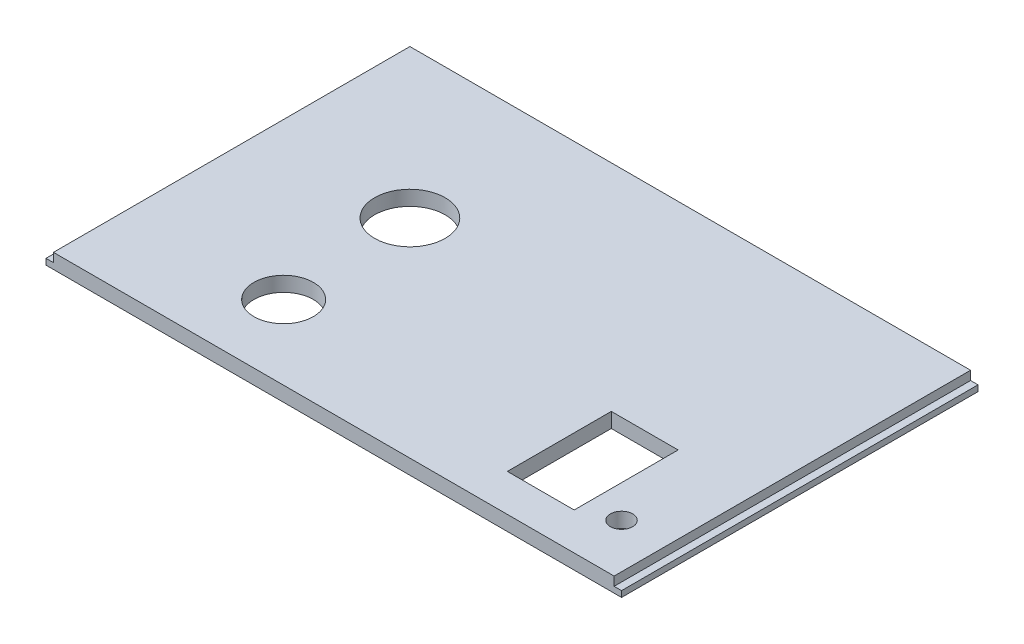
ISO-10303-21;
HEADER;
FILE_DESCRIPTION(('STEP AP214'),'2;1');
FILE_NAME('part.step','',(''),(''),'','','');
FILE_SCHEMA(('AUTOMOTIVE_DESIGN { 1 0 10303 214 1 1 1 1 }'));
ENDSEC;
DATA;
#1=APPLICATION_CONTEXT('core data for automotive mechanical design processes');
#2=APPLICATION_PROTOCOL_DEFINITION('international standard','automotive_design',2000,#1);
#3=PRODUCT_CONTEXT('',#1,'mechanical');
#4=PRODUCT('Part','Part','',(#3));
#5=PRODUCT_RELATED_PRODUCT_CATEGORY('part','',(#4));
#6=PRODUCT_DEFINITION_FORMATION('','',#4);
#7=PRODUCT_DEFINITION_CONTEXT('part definition',#1,'design');
#8=PRODUCT_DEFINITION('design','',#6,#7);
#9=PRODUCT_DEFINITION_SHAPE('','',#8);
#10=(LENGTH_UNIT() NAMED_UNIT(*) SI_UNIT(.MILLI.,.METRE.));
#11=(NAMED_UNIT(*) PLANE_ANGLE_UNIT() SI_UNIT($,.RADIAN.));
#12=(NAMED_UNIT(*) SI_UNIT($,.STERADIAN.) SOLID_ANGLE_UNIT());
#13=UNCERTAINTY_MEASURE_WITH_UNIT(LENGTH_MEASURE(1.E-05),#10,'distance_accuracy_value','');
#14=(GEOMETRIC_REPRESENTATION_CONTEXT(3) GLOBAL_UNCERTAINTY_ASSIGNED_CONTEXT((#13)) GLOBAL_UNIT_ASSIGNED_CONTEXT((#10,
#11,#12)) REPRESENTATION_CONTEXT('',''));
#15=CARTESIAN_POINT('',(0.,0.,0.));
#16=DIRECTION('',(0.,0.,1.));
#17=DIRECTION('',(1.,0.,0.));
#18=AXIS2_PLACEMENT_3D('',#15,#16,#17);
#19=CARTESIAN_POINT('',(0.,2.,0.));
#20=DIRECTION('',(1.,0.,0.));
#21=DIRECTION('',(0.,0.,-1.));
#22=AXIS2_PLACEMENT_3D('',#19,#20,#21);
#23=PLANE('',#22);
#24=DIRECTION('',(0.,0.,1.));
#25=VECTOR('',#24,1.);
#26=CARTESIAN_POINT('',(0.,0.8,-48.));
#27=LINE('',#26,#25);
#28=CARTESIAN_POINT('',(0.,0.8,-48.));
#29=VERTEX_POINT('',#28);
#30=CARTESIAN_POINT('',(0.,0.8,0.));
#31=VERTEX_POINT('',#30);
#32=EDGE_CURVE('E175',#29,#31,#27,.T.);
#33=ORIENTED_EDGE('',*,*,#32,.F.);
#34=DIRECTION('',(0.,-1.,0.));
#35=VECTOR('',#34,1.);
#36=CARTESIAN_POINT('',(0.,2.,-48.));
#37=LINE('',#36,#35);
#38=CARTESIAN_POINT('',(0.,0.,-48.));
#39=VERTEX_POINT('',#38);
#40=EDGE_CURVE('E232',#29,#39,#37,.T.);
#41=ORIENTED_EDGE('',*,*,#40,.T.);
#42=DIRECTION('',(0.,0.,1.));
#43=VECTOR('',#42,1.);
#44=CARTESIAN_POINT('',(0.,0.,0.));
#45=LINE('',#44,#43);
#46=CARTESIAN_POINT('',(0.,0.,0.));
#47=VERTEX_POINT('',#46);
#48=EDGE_CURVE('E198',#39,#47,#45,.T.);
#49=ORIENTED_EDGE('',*,*,#48,.T.);
#50=DIRECTION('',(0.,-1.,0.));
#51=VECTOR('',#50,1.);
#52=CARTESIAN_POINT('',(0.,2.,0.));
#53=LINE('',#52,#51);
#54=EDGE_CURVE('E255',#31,#47,#53,.T.);
#55=ORIENTED_EDGE('',*,*,#54,.F.);
#56=EDGE_LOOP('',(#33,#41,#49,#55));
#57=FACE_BOUND('',#56,.T.);
#58=ADVANCED_FACE('F39',(#57),#23,.F.);
#59=CARTESIAN_POINT('',(0.,2.,0.));
#60=DIRECTION('',(0.,0.,-1.));
#61=DIRECTION('',(-1.,0.,0.));
#62=AXIS2_PLACEMENT_3D('',#59,#60,#61);
#63=PLANE('',#62);
#64=DIRECTION('',(1.,0.,0.));
#65=VECTOR('',#64,1.);
#66=CARTESIAN_POINT('',(0.,2.,0.));
#67=LINE('',#66,#65);
#68=CARTESIAN_POINT('',(1.00000000000001,2.,0.));
#69=VERTEX_POINT('',#68);
#70=CARTESIAN_POINT('',(76.5,2.,0.));
#71=VERTEX_POINT('',#70);
#72=EDGE_CURVE('E223',#69,#71,#67,.T.);
#73=ORIENTED_EDGE('',*,*,#72,.F.);
#74=DIRECTION('',(0.,1.,0.));
#75=VECTOR('',#74,1.);
#76=CARTESIAN_POINT('',(1.00000000000001,0.8,0.));
#77=LINE('',#76,#75);
#78=CARTESIAN_POINT('',(1.00000000000001,0.8,0.));
#79=VERTEX_POINT('',#78);
#80=EDGE_CURVE('E190',#79,#69,#77,.T.);
#81=ORIENTED_EDGE('',*,*,#80,.F.);
#82=DIRECTION('',(1.,0.,0.));
#83=VECTOR('',#82,1.);
#84=CARTESIAN_POINT('',(0.,0.8,0.));
#85=LINE('',#84,#83);
#86=EDGE_CURVE('E178',#31,#79,#85,.T.);
#87=ORIENTED_EDGE('',*,*,#86,.F.);
#88=ORIENTED_EDGE('',*,*,#54,.T.);
#89=DIRECTION('',(1.,0.,0.));
#90=VECTOR('',#89,1.);
#91=CARTESIAN_POINT('',(0.,0.,0.));
#92=LINE('',#91,#90);
#93=CARTESIAN_POINT('',(77.5,0.,0.));
#94=VERTEX_POINT('',#93);
#95=EDGE_CURVE('E236',#47,#94,#92,.T.);
#96=ORIENTED_EDGE('',*,*,#95,.T.);
#97=DIRECTION('',(0.,-1.,0.));
#98=VECTOR('',#97,1.);
#99=CARTESIAN_POINT('',(77.5,2.,0.));
#100=LINE('',#99,#98);
#101=CARTESIAN_POINT('',(77.5,0.8,0.));
#102=VERTEX_POINT('',#101);
#103=EDGE_CURVE('E252',#102,#94,#100,.T.);
#104=ORIENTED_EDGE('',*,*,#103,.F.);
#105=DIRECTION('',(1.,0.,0.));
#106=VECTOR('',#105,1.);
#107=CARTESIAN_POINT('',(77.5,0.8,0.));
#108=LINE('',#107,#106);
#109=CARTESIAN_POINT('',(76.5,0.8,0.));
#110=VERTEX_POINT('',#109);
#111=EDGE_CURVE('E212',#110,#102,#108,.T.);
#112=ORIENTED_EDGE('',*,*,#111,.F.);
#113=DIRECTION('',(0.,1.,0.));
#114=VECTOR('',#113,1.);
#115=CARTESIAN_POINT('',(76.5,0.8,0.));
#116=LINE('',#115,#114);
#117=EDGE_CURVE('E193',#110,#71,#116,.T.);
#118=ORIENTED_EDGE('',*,*,#117,.T.);
#119=EDGE_LOOP('',(#73,#81,#87,#88,#96,#104,#112,#118));
#120=FACE_BOUND('',#119,.T.);
#121=ADVANCED_FACE('F303',(#120),#63,.F.);
#122=CARTESIAN_POINT('',(77.5,2.,0.));
#123=DIRECTION('',(-1.,0.,0.));
#124=DIRECTION('',(0.,0.,1.));
#125=AXIS2_PLACEMENT_3D('',#122,#123,#124);
#126=PLANE('',#125);
#127=DIRECTION('',(0.,-1.,0.));
#128=VECTOR('',#127,1.);
#129=CARTESIAN_POINT('',(77.5,2.,-48.));
#130=LINE('',#129,#128);
#131=CARTESIAN_POINT('',(77.5,0.8,-48.));
#132=VERTEX_POINT('',#131);
#133=CARTESIAN_POINT('',(77.5,0.,-48.));
#134=VERTEX_POINT('',#133);
#135=EDGE_CURVE('E249',#132,#134,#130,.T.);
#136=ORIENTED_EDGE('',*,*,#135,.F.);
#137=DIRECTION('',(0.,0.,-1.));
#138=VECTOR('',#137,1.);
#139=CARTESIAN_POINT('',(77.5,0.8,-48.));
#140=LINE('',#139,#138);
#141=EDGE_CURVE('E201',#102,#132,#140,.T.);
#142=ORIENTED_EDGE('',*,*,#141,.F.);
#143=ORIENTED_EDGE('',*,*,#103,.T.);
#144=DIRECTION('',(0.,0.,-1.));
#145=VECTOR('',#144,1.);
#146=CARTESIAN_POINT('',(77.5,0.,0.));
#147=LINE('',#146,#145);
#148=EDGE_CURVE('E240',#94,#134,#147,.T.);
#149=ORIENTED_EDGE('',*,*,#148,.T.);
#150=EDGE_LOOP('',(#136,#142,#143,#149));
#151=FACE_BOUND('',#150,.T.);
#152=ADVANCED_FACE('F298',(#151),#126,.F.);
#153=CARTESIAN_POINT('',(0.,2.,-48.));
#154=DIRECTION('',(0.,0.,1.));
#155=DIRECTION('',(1.,0.,0.));
#156=AXIS2_PLACEMENT_3D('',#153,#154,#155);
#157=PLANE('',#156);
#158=DIRECTION('',(-1.,0.,0.));
#159=VECTOR('',#158,1.);
#160=CARTESIAN_POINT('',(0.,0.8,-48.));
#161=LINE('',#160,#159);
#162=CARTESIAN_POINT('',(1.,0.8,-48.));
#163=VERTEX_POINT('',#162);
#164=EDGE_CURVE('E187',#163,#29,#161,.T.);
#165=ORIENTED_EDGE('',*,*,#164,.F.);
#166=DIRECTION('',(0.,1.,0.));
#167=VECTOR('',#166,1.);
#168=CARTESIAN_POINT('',(1.,0.8,-48.));
#169=LINE('',#168,#167);
#170=CARTESIAN_POINT('',(1.,2.,-48.));
#171=VERTEX_POINT('',#170);
#172=EDGE_CURVE('E194',#163,#171,#169,.T.);
#173=ORIENTED_EDGE('',*,*,#172,.T.);
#174=DIRECTION('',(-1.,0.,0.));
#175=VECTOR('',#174,1.);
#176=CARTESIAN_POINT('',(0.,2.,-48.));
#177=LINE('',#176,#175);
#178=CARTESIAN_POINT('',(76.5,2.,-48.));
#179=VERTEX_POINT('',#178);
#180=EDGE_CURVE('E227',#179,#171,#177,.T.);
#181=ORIENTED_EDGE('',*,*,#180,.F.);
#182=DIRECTION('',(0.,1.,0.));
#183=VECTOR('',#182,1.);
#184=CARTESIAN_POINT('',(76.5,0.8,-48.));
#185=LINE('',#184,#183);
#186=CARTESIAN_POINT('',(76.5,0.8,-48.));
#187=VERTEX_POINT('',#186);
#188=EDGE_CURVE('E215',#187,#179,#185,.T.);
#189=ORIENTED_EDGE('',*,*,#188,.F.);
#190=DIRECTION('',(-1.,0.,0.));
#191=VECTOR('',#190,1.);
#192=CARTESIAN_POINT('',(77.5,0.8,-48.));
#193=LINE('',#192,#191);
#194=EDGE_CURVE('E204',#132,#187,#193,.T.);
#195=ORIENTED_EDGE('',*,*,#194,.F.);
#196=ORIENTED_EDGE('',*,*,#135,.T.);
#197=DIRECTION('',(-1.,0.,0.));
#198=VECTOR('',#197,1.);
#199=CARTESIAN_POINT('',(0.,0.,-48.));
#200=LINE('',#199,#198);
#201=EDGE_CURVE('E228',#134,#39,#200,.T.);
#202=ORIENTED_EDGE('',*,*,#201,.T.);
#203=ORIENTED_EDGE('',*,*,#40,.F.);
#204=EDGE_LOOP('',(#165,#173,#181,#189,#195,#196,#202,#203));
#205=FACE_BOUND('',#204,.T.);
#206=ADVANCED_FACE('F289',(#205),#157,.F.);
#207=CARTESIAN_POINT('',(0.,2.,0.));
#208=DIRECTION('',(0.,-1.,0.));
#209=DIRECTION('',(0.,0.,-1.));
#210=AXIS2_PLACEMENT_3D('',#207,#208,#209);
#211=PLANE('',#210);
#212=CARTESIAN_POINT('',(21.,2.,-28.));
#213=DIRECTION('',(0.,1.,0.));
#214=DIRECTION('',(0.,0.,1.));
#215=AXIS2_PLACEMENT_3D('',#212,#213,#214);
#216=CIRCLE('',#215,4.75);
#217=CARTESIAN_POINT('',(21.,2.,-23.25));
#218=VERTEX_POINT('',#217);
#219=EDGE_CURVE('E274',#218,#218,#216,.T.);
#220=ORIENTED_EDGE('',*,*,#219,.F.);
#221=EDGE_LOOP('',(#220));
#222=FACE_BOUND('',#221,.T.);
#223=CARTESIAN_POINT('',(70.5,2.,-7.));
#224=DIRECTION('',(0.,1.,0.));
#225=DIRECTION('',(0.,0.,1.));
#226=AXIS2_PLACEMENT_3D('',#223,#224,#225);
#227=CIRCLE('',#226,1.5);
#228=CARTESIAN_POINT('',(70.5,2.,-5.5));
#229=VERTEX_POINT('',#228);
#230=EDGE_CURVE('E160',#229,#229,#227,.T.);
#231=ORIENTED_EDGE('',*,*,#230,.F.);
#232=EDGE_LOOP('',(#231));
#233=FACE_BOUND('',#232,.T.);
#234=DIRECTION('',(1.,0.,0.));
#235=VECTOR('',#234,1.);
#236=CARTESIAN_POINT('',(57.1084226261721,2.,-5.01303201692949));
#237=LINE('',#236,#235);
#238=CARTESIAN_POINT('',(57.1084226261721,2.,-5.01303201692949));
#239=VERTEX_POINT('',#238);
#240=CARTESIAN_POINT('',(66.1084226261721,2.,-5.01303201692949));
#241=VERTEX_POINT('',#240);
#242=EDGE_CURVE('E142',#239,#241,#237,.T.);
#243=ORIENTED_EDGE('',*,*,#242,.F.);
#244=DIRECTION('',(0.,0.,1.));
#245=VECTOR('',#244,1.);
#246=CARTESIAN_POINT('',(57.1084226261721,2.,-19.0130320169295));
#247=LINE('',#246,#245);
#248=CARTESIAN_POINT('',(57.1084226261721,2.,-19.0130320169295));
#249=VERTEX_POINT('',#248);
#250=EDGE_CURVE('E56',#249,#239,#247,.T.);
#251=ORIENTED_EDGE('',*,*,#250,.F.);
#252=DIRECTION('',(-1.,0.,0.));
#253=VECTOR('',#252,1.);
#254=CARTESIAN_POINT('',(57.1084226261721,2.,-19.0130320169295));
#255=LINE('',#254,#253);
#256=CARTESIAN_POINT('',(66.1084226261721,2.,-19.0130320169295));
#257=VERTEX_POINT('',#256);
#258=EDGE_CURVE('E150',#257,#249,#255,.T.);
#259=ORIENTED_EDGE('',*,*,#258,.F.);
#260=DIRECTION('',(0.,0.,-1.));
#261=VECTOR('',#260,1.);
#262=CARTESIAN_POINT('',(66.1084226261721,2.,-19.0130320169295));
#263=LINE('',#262,#261);
#264=EDGE_CURVE('E132',#241,#257,#263,.T.);
#265=ORIENTED_EDGE('',*,*,#264,.F.);
#266=EDGE_LOOP('',(#243,#251,#259,#265));
#267=FACE_BOUND('',#266,.T.);
#268=CARTESIAN_POINT('',(22.,2.,-10.));
#269=DIRECTION('',(0.,1.,0.));
#270=DIRECTION('',(0.,0.,1.));
#271=AXIS2_PLACEMENT_3D('',#268,#269,#270);
#272=CIRCLE('',#271,4.);
#273=CARTESIAN_POINT('',(22.,2.,-6.));
#274=VERTEX_POINT('',#273);
#275=EDGE_CURVE('E170',#274,#274,#272,.T.);
#276=ORIENTED_EDGE('',*,*,#275,.F.);
#277=EDGE_LOOP('',(#276));
#278=FACE_BOUND('',#277,.T.);
#279=ORIENTED_EDGE('',*,*,#180,.T.);
#280=DIRECTION('',(0.,0.,-1.));
#281=VECTOR('',#280,1.);
#282=CARTESIAN_POINT('',(1.,2.,-48.));
#283=LINE('',#282,#281);
#284=EDGE_CURVE('E179',#69,#171,#283,.T.);
#285=ORIENTED_EDGE('',*,*,#284,.F.);
#286=ORIENTED_EDGE('',*,*,#72,.T.);
#287=DIRECTION('',(0.,0.,1.));
#288=VECTOR('',#287,1.);
#289=CARTESIAN_POINT('',(76.5,2.,-48.));
#290=LINE('',#289,#288);
#291=EDGE_CURVE('E169',#179,#71,#290,.T.);
#292=ORIENTED_EDGE('',*,*,#291,.F.);
#293=EDGE_LOOP('',(#279,#285,#286,#292));
#294=FACE_BOUND('',#293,.T.);
#295=ADVANCED_FACE('F147',(#222,#233,#267,#278,#294),#211,.F.);
#296=CARTESIAN_POINT('',(0.,0.,0.));
#297=DIRECTION('',(0.,-1.,0.));
#298=DIRECTION('',(0.,0.,-1.));
#299=AXIS2_PLACEMENT_3D('',#296,#297,#298);
#300=PLANE('',#299);
#301=CARTESIAN_POINT('',(21.,0.,-28.));
#302=DIRECTION('',(0.,-1.,0.));
#303=DIRECTION('',(0.,0.,-1.));
#304=AXIS2_PLACEMENT_3D('',#301,#302,#303);
#305=CIRCLE('',#304,4.75);
#306=CARTESIAN_POINT('',(21.,0.,-32.75));
#307=VERTEX_POINT('',#306);
#308=EDGE_CURVE('E42',#307,#307,#305,.T.);
#309=ORIENTED_EDGE('',*,*,#308,.F.);
#310=EDGE_LOOP('',(#309));
#311=FACE_BOUND('',#310,.T.);
#312=CARTESIAN_POINT('',(70.5,0.,-7.));
#313=DIRECTION('',(0.,-1.,0.));
#314=DIRECTION('',(0.,0.,-1.));
#315=AXIS2_PLACEMENT_3D('',#312,#313,#314);
#316=CIRCLE('',#315,1.5);
#317=CARTESIAN_POINT('',(70.5,0.,-8.5));
#318=VERTEX_POINT('',#317);
#319=EDGE_CURVE('E174',#318,#318,#316,.T.);
#320=ORIENTED_EDGE('',*,*,#319,.F.);
#321=EDGE_LOOP('',(#320));
#322=FACE_BOUND('',#321,.T.);
#323=DIRECTION('',(0.,0.,-1.));
#324=VECTOR('',#323,1.);
#325=CARTESIAN_POINT('',(57.1084226261721,0.,0.));
#326=LINE('',#325,#324);
#327=CARTESIAN_POINT('',(57.1084226261721,0.,-5.01303201692949));
#328=VERTEX_POINT('',#327);
#329=CARTESIAN_POINT('',(57.1084226261721,0.,-19.0130320169295));
#330=VERTEX_POINT('',#329);
#331=EDGE_CURVE('E11',#328,#330,#326,.T.);
#332=ORIENTED_EDGE('',*,*,#331,.F.);
#333=DIRECTION('',(-1.,0.,0.));
#334=VECTOR('',#333,1.);
#335=CARTESIAN_POINT('',(0.,0.,-5.01303201692949));
#336=LINE('',#335,#334);
#337=CARTESIAN_POINT('',(66.1084226261721,0.,-5.01303201692949));
#338=VERTEX_POINT('',#337);
#339=EDGE_CURVE('E258',#338,#328,#336,.T.);
#340=ORIENTED_EDGE('',*,*,#339,.F.);
#341=DIRECTION('',(0.,0.,1.));
#342=VECTOR('',#341,1.);
#343=CARTESIAN_POINT('',(66.1084226261721,0.,0.));
#344=LINE('',#343,#342);
#345=CARTESIAN_POINT('',(66.1084226261721,0.,-19.0130320169295));
#346=VERTEX_POINT('',#345);
#347=EDGE_CURVE('E135',#346,#338,#344,.T.);
#348=ORIENTED_EDGE('',*,*,#347,.F.);
#349=DIRECTION('',(1.,0.,0.));
#350=VECTOR('',#349,1.);
#351=CARTESIAN_POINT('',(0.,0.,-19.0130320169295));
#352=LINE('',#351,#350);
#353=EDGE_CURVE('E48',#330,#346,#352,.T.);
#354=ORIENTED_EDGE('',*,*,#353,.F.);
#355=EDGE_LOOP('',(#332,#340,#348,#354));
#356=FACE_BOUND('',#355,.T.);
#357=CARTESIAN_POINT('',(22.,0.,-10.));
#358=DIRECTION('',(0.,1.,0.));
#359=DIRECTION('',(0.,0.,1.));
#360=AXIS2_PLACEMENT_3D('',#357,#358,#359);
#361=CIRCLE('',#360,4.);
#362=CARTESIAN_POINT('',(22.,0.,-6.));
#363=VERTEX_POINT('',#362);
#364=EDGE_CURVE('E165',#363,#363,#361,.T.);
#365=ORIENTED_EDGE('',*,*,#364,.T.);
#366=EDGE_LOOP('',(#365));
#367=FACE_BOUND('',#366,.T.);
#368=ORIENTED_EDGE('',*,*,#48,.F.);
#369=ORIENTED_EDGE('',*,*,#201,.F.);
#370=ORIENTED_EDGE('',*,*,#148,.F.);
#371=ORIENTED_EDGE('',*,*,#95,.F.);
#372=EDGE_LOOP('',(#368,#369,#370,#371));
#373=FACE_BOUND('',#372,.T.);
#374=ADVANCED_FACE('F288',(#311,#322,#356,#367,#373),#300,.T.);
#375=CARTESIAN_POINT('',(76.5,0.8,-48.));
#376=DIRECTION('',(-1.,0.,0.));
#377=DIRECTION('',(0.,0.,1.));
#378=AXIS2_PLACEMENT_3D('',#375,#376,#377);
#379=PLANE('',#378);
#380=ORIENTED_EDGE('',*,*,#291,.T.);
#381=ORIENTED_EDGE('',*,*,#117,.F.);
#382=DIRECTION('',(0.,0.,1.));
#383=VECTOR('',#382,1.);
#384=CARTESIAN_POINT('',(76.5,0.8,-48.));
#385=LINE('',#384,#383);
#386=EDGE_CURVE('E208',#187,#110,#385,.T.);
#387=ORIENTED_EDGE('',*,*,#386,.F.);
#388=ORIENTED_EDGE('',*,*,#188,.T.);
#389=EDGE_LOOP('',(#380,#381,#387,#388));
#390=FACE_BOUND('',#389,.T.);
#391=ADVANCED_FACE('F295',(#390),#379,.F.);
#392=CARTESIAN_POINT('',(0.,0.8,0.));
#393=DIRECTION('',(0.,-1.,0.));
#394=DIRECTION('',(0.,0.,-1.));
#395=AXIS2_PLACEMENT_3D('',#392,#393,#394);
#396=PLANE('',#395);
#397=ORIENTED_EDGE('',*,*,#141,.T.);
#398=ORIENTED_EDGE('',*,*,#194,.T.);
#399=ORIENTED_EDGE('',*,*,#386,.T.);
#400=ORIENTED_EDGE('',*,*,#111,.T.);
#401=EDGE_LOOP('',(#397,#398,#399,#400));
#402=FACE_BOUND('',#401,.T.);
#403=ADVANCED_FACE('F337',(#402),#396,.F.);
#404=CARTESIAN_POINT('',(1.,0.8,-48.));
#405=DIRECTION('',(1.,0.,0.));
#406=DIRECTION('',(0.,0.,-1.));
#407=AXIS2_PLACEMENT_3D('',#404,#405,#406);
#408=PLANE('',#407);
#409=ORIENTED_EDGE('',*,*,#284,.T.);
#410=ORIENTED_EDGE('',*,*,#172,.F.);
#411=DIRECTION('',(0.,0.,-1.));
#412=VECTOR('',#411,1.);
#413=CARTESIAN_POINT('',(1.,0.8,-48.));
#414=LINE('',#413,#412);
#415=EDGE_CURVE('E183',#79,#163,#414,.T.);
#416=ORIENTED_EDGE('',*,*,#415,.F.);
#417=ORIENTED_EDGE('',*,*,#80,.T.);
#418=EDGE_LOOP('',(#409,#410,#416,#417));
#419=FACE_BOUND('',#418,.T.);
#420=ADVANCED_FACE('F328',(#419),#408,.F.);
#421=CARTESIAN_POINT('',(0.,0.8,0.));
#422=DIRECTION('',(0.,1.,0.));
#423=DIRECTION('',(0.,0.,1.));
#424=AXIS2_PLACEMENT_3D('',#421,#422,#423);
#425=PLANE('',#424);
#426=ORIENTED_EDGE('',*,*,#32,.T.);
#427=ORIENTED_EDGE('',*,*,#86,.T.);
#428=ORIENTED_EDGE('',*,*,#415,.T.);
#429=ORIENTED_EDGE('',*,*,#164,.T.);
#430=EDGE_LOOP('',(#426,#427,#428,#429));
#431=FACE_BOUND('',#430,.T.);
#432=ADVANCED_FACE('F326',(#431),#425,.T.);
#433=CARTESIAN_POINT('',(22.,0.,-10.));
#434=DIRECTION('',(0.,1.,0.));
#435=DIRECTION('',(0.,0.,1.));
#436=AXIS2_PLACEMENT_3D('',#433,#434,#435);
#437=CYLINDRICAL_SURFACE('',#436,4.);
#438=ORIENTED_EDGE('',*,*,#364,.F.);
#439=EDGE_LOOP('',(#438));
#440=FACE_BOUND('',#439,.T.);
#441=ORIENTED_EDGE('',*,*,#275,.T.);
#442=EDGE_LOOP('',(#441));
#443=FACE_BOUND('',#442,.T.);
#444=ADVANCED_FACE('F383',(#440,#443),#437,.F.);
#445=CARTESIAN_POINT('',(57.1084226261721,-10.,-19.0130320169295));
#446=DIRECTION('',(-1.,0.,0.));
#447=DIRECTION('',(0.,0.,1.));
#448=AXIS2_PLACEMENT_3D('',#445,#446,#447);
#449=PLANE('',#448);
#450=ORIENTED_EDGE('',*,*,#331,.T.);
#451=DIRECTION('',(0.,1.,0.));
#452=VECTOR('',#451,1.);
#453=CARTESIAN_POINT('',(57.1084226261721,-10.,-19.0130320169295));
#454=LINE('',#453,#452);
#455=EDGE_CURVE('E157',#330,#249,#454,.T.);
#456=ORIENTED_EDGE('',*,*,#455,.T.);
#457=ORIENTED_EDGE('',*,*,#250,.T.);
#458=DIRECTION('',(0.,1.,0.));
#459=VECTOR('',#458,1.);
#460=CARTESIAN_POINT('',(57.1084226261721,-10.,-5.01303201692949));
#461=LINE('',#460,#459);
#462=EDGE_CURVE('E139',#328,#239,#461,.T.);
#463=ORIENTED_EDGE('',*,*,#462,.F.);
#464=EDGE_LOOP('',(#450,#456,#457,#463));
#465=FACE_BOUND('',#464,.T.);
#466=ADVANCED_FACE('F392',(#465),#449,.F.);
#467=CARTESIAN_POINT('',(57.1084226261721,-10.,-19.0130320169295));
#468=DIRECTION('',(0.,0.,-1.));
#469=DIRECTION('',(-1.,0.,0.));
#470=AXIS2_PLACEMENT_3D('',#467,#468,#469);
#471=PLANE('',#470);
#472=ORIENTED_EDGE('',*,*,#353,.T.);
#473=DIRECTION('',(0.,1.,0.));
#474=VECTOR('',#473,1.);
#475=CARTESIAN_POINT('',(66.1084226261721,-10.,-19.0130320169295));
#476=LINE('',#475,#474);
#477=EDGE_CURVE('E138',#346,#257,#476,.T.);
#478=ORIENTED_EDGE('',*,*,#477,.T.);
#479=ORIENTED_EDGE('',*,*,#258,.T.);
#480=ORIENTED_EDGE('',*,*,#455,.F.);
#481=EDGE_LOOP('',(#472,#478,#479,#480));
#482=FACE_BOUND('',#481,.T.);
#483=ADVANCED_FACE('F402',(#482),#471,.F.);
#484=CARTESIAN_POINT('',(66.1084226261721,-10.,-19.0130320169295));
#485=DIRECTION('',(1.,0.,0.));
#486=DIRECTION('',(0.,0.,-1.));
#487=AXIS2_PLACEMENT_3D('',#484,#485,#486);
#488=PLANE('',#487);
#489=ORIENTED_EDGE('',*,*,#347,.T.);
#490=DIRECTION('',(0.,1.,0.));
#491=VECTOR('',#490,1.);
#492=CARTESIAN_POINT('',(66.1084226261721,-10.,-5.01303201692949));
#493=LINE('',#492,#491);
#494=EDGE_CURVE('E64',#338,#241,#493,.T.);
#495=ORIENTED_EDGE('',*,*,#494,.T.);
#496=ORIENTED_EDGE('',*,*,#264,.T.);
#497=ORIENTED_EDGE('',*,*,#477,.F.);
#498=EDGE_LOOP('',(#489,#495,#496,#497));
#499=FACE_BOUND('',#498,.T.);
#500=ADVANCED_FACE('F129',(#499),#488,.F.);
#501=CARTESIAN_POINT('',(57.1084226261721,-10.,-5.01303201692949));
#502=DIRECTION('',(0.,0.,1.));
#503=DIRECTION('',(1.,0.,0.));
#504=AXIS2_PLACEMENT_3D('',#501,#502,#503);
#505=PLANE('',#504);
#506=ORIENTED_EDGE('',*,*,#339,.T.);
#507=ORIENTED_EDGE('',*,*,#462,.T.);
#508=ORIENTED_EDGE('',*,*,#242,.T.);
#509=ORIENTED_EDGE('',*,*,#494,.F.);
#510=EDGE_LOOP('',(#506,#507,#508,#509));
#511=FACE_BOUND('',#510,.T.);
#512=ADVANCED_FACE('F143',(#511),#505,.F.);
#513=CARTESIAN_POINT('',(70.5,-10.,-7.));
#514=DIRECTION('',(0.,1.,0.));
#515=DIRECTION('',(0.,0.,1.));
#516=AXIS2_PLACEMENT_3D('',#513,#514,#515);
#517=CYLINDRICAL_SURFACE('',#516,1.5);
#518=ORIENTED_EDGE('',*,*,#319,.T.);
#519=EDGE_LOOP('',(#518));
#520=FACE_BOUND('',#519,.T.);
#521=ORIENTED_EDGE('',*,*,#230,.T.);
#522=EDGE_LOOP('',(#521));
#523=FACE_BOUND('',#522,.T.);
#524=ADVANCED_FACE('F428',(#520,#523),#517,.F.);
#525=CARTESIAN_POINT('',(21.,-10.,-28.));
#526=DIRECTION('',(0.,1.,0.));
#527=DIRECTION('',(0.,0.,1.));
#528=AXIS2_PLACEMENT_3D('',#525,#526,#527);
#529=CYLINDRICAL_SURFACE('',#528,4.75);
#530=ORIENTED_EDGE('',*,*,#308,.T.);
#531=EDGE_LOOP('',(#530));
#532=FACE_BOUND('',#531,.T.);
#533=ORIENTED_EDGE('',*,*,#219,.T.);
#534=EDGE_LOOP('',(#533));
#535=FACE_BOUND('',#534,.T.);
#536=ADVANCED_FACE('F284',(#532,#535),#529,.F.);
#537=CLOSED_SHELL('',(#58,#121,#152,#206,#295,#374,#391,#403,#420,#432,#444,#466,#483,#500,#512,
#524,#536));
#538=MANIFOLD_SOLID_BREP('B2',#537);
#539=ADVANCED_BREP_SHAPE_REPRESENTATION('',(#18,#538),#14);
#540=SHAPE_DEFINITION_REPRESENTATION(#9,#539);
ENDSEC;
END-ISO-10303-21;
